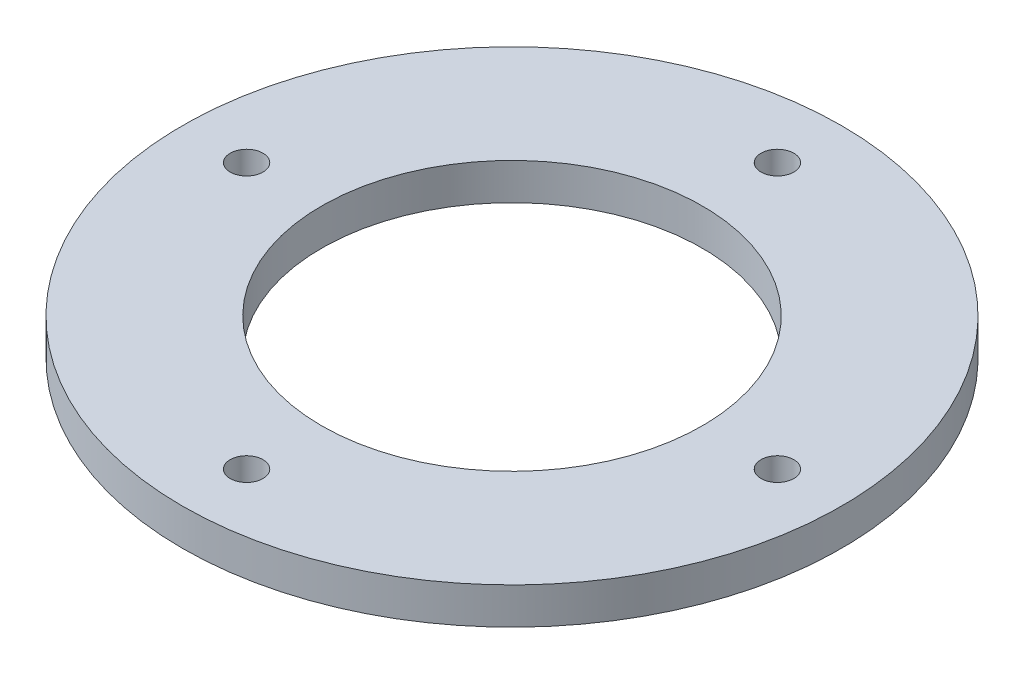
ISO-10303-21;
HEADER;
FILE_DESCRIPTION(('STEP AP214'),'2;1');
FILE_NAME('part.step','',(''),(''),'','','');
FILE_SCHEMA(('AUTOMOTIVE_DESIGN { 1 0 10303 214 1 1 1 1 }'));
ENDSEC;
DATA;
#1=APPLICATION_CONTEXT('core data for automotive mechanical design processes');
#2=APPLICATION_PROTOCOL_DEFINITION('international standard','automotive_design',2000,#1);
#3=PRODUCT_CONTEXT('',#1,'mechanical');
#4=PRODUCT('Part','Part','',(#3));
#5=PRODUCT_RELATED_PRODUCT_CATEGORY('part','',(#4));
#6=PRODUCT_DEFINITION_FORMATION('','',#4);
#7=PRODUCT_DEFINITION_CONTEXT('part definition',#1,'design');
#8=PRODUCT_DEFINITION('design','',#6,#7);
#9=PRODUCT_DEFINITION_SHAPE('','',#8);
#10=(LENGTH_UNIT() NAMED_UNIT(*) SI_UNIT(.MILLI.,.METRE.));
#11=(NAMED_UNIT(*) PLANE_ANGLE_UNIT() SI_UNIT($,.RADIAN.));
#12=(NAMED_UNIT(*) SI_UNIT($,.STERADIAN.) SOLID_ANGLE_UNIT());
#13=UNCERTAINTY_MEASURE_WITH_UNIT(LENGTH_MEASURE(1.E-05),#10,'distance_accuracy_value','');
#14=(GEOMETRIC_REPRESENTATION_CONTEXT(3) GLOBAL_UNCERTAINTY_ASSIGNED_CONTEXT((#13)) GLOBAL_UNIT_ASSIGNED_CONTEXT((#10,
#11,#12)) REPRESENTATION_CONTEXT('',''));
#15=CARTESIAN_POINT('',(0.,0.,0.));
#16=DIRECTION('',(0.,0.,1.));
#17=DIRECTION('',(1.,0.,0.));
#18=AXIS2_PLACEMENT_3D('',#15,#16,#17);
#19=CARTESIAN_POINT('',(0.,3.175,0.));
#20=DIRECTION('',(0.,1.,0.));
#21=DIRECTION('',(0.,0.,1.));
#22=AXIS2_PLACEMENT_3D('',#19,#20,#21);
#23=PLANE('',#22);
#24=CARTESIAN_POINT('',(-23.0124,3.175,0.));
#25=DIRECTION('',(0.,1.,0.));
#26=DIRECTION('',(0.,0.,1.));
#27=AXIS2_PLACEMENT_3D('',#24,#25,#26);
#28=CIRCLE('',#27,1.4224);
#29=CARTESIAN_POINT('',(-23.0124,3.175,1.4224));
#30=VERTEX_POINT('',#29);
#31=EDGE_CURVE('E61',#30,#30,#28,.T.);
#32=ORIENTED_EDGE('',*,*,#31,.F.);
#33=EDGE_LOOP('',(#32));
#34=FACE_BOUND('',#33,.T.);
#35=CARTESIAN_POINT('',(23.0124,3.175,0.));
#36=DIRECTION('',(0.,1.,0.));
#37=DIRECTION('',(0.,0.,1.));
#38=AXIS2_PLACEMENT_3D('',#35,#36,#37);
#39=CIRCLE('',#38,1.4224);
#40=CARTESIAN_POINT('',(23.0124,3.175,1.4224));
#41=VERTEX_POINT('',#40);
#42=EDGE_CURVE('E49',#41,#41,#39,.T.);
#43=ORIENTED_EDGE('',*,*,#42,.F.);
#44=EDGE_LOOP('',(#43));
#45=FACE_BOUND('',#44,.T.);
#46=CARTESIAN_POINT('',(0.,3.175,0.));
#47=DIRECTION('',(0.,1.,0.));
#48=DIRECTION('',(0.,0.,1.));
#49=AXIS2_PLACEMENT_3D('',#46,#47,#48);
#50=CIRCLE('',#49,28.575);
#51=CARTESIAN_POINT('',(0.,3.175,28.575));
#52=VERTEX_POINT('',#51);
#53=EDGE_CURVE('E10',#52,#52,#50,.T.);
#54=ORIENTED_EDGE('',*,*,#53,.T.);
#55=EDGE_LOOP('',(#54));
#56=FACE_BOUND('',#55,.T.);
#57=CARTESIAN_POINT('',(0.,3.175,0.));
#58=DIRECTION('',(0.,1.,0.));
#59=DIRECTION('',(0.,0.,1.));
#60=AXIS2_PLACEMENT_3D('',#57,#58,#59);
#61=CIRCLE('',#60,16.51);
#62=CARTESIAN_POINT('',(0.,3.175,16.51));
#63=VERTEX_POINT('',#62);
#64=EDGE_CURVE('E44',#63,#63,#61,.T.);
#65=ORIENTED_EDGE('',*,*,#64,.F.);
#66=EDGE_LOOP('',(#65));
#67=FACE_BOUND('',#66,.T.);
#68=CARTESIAN_POINT('',(0.,3.175,23.0124));
#69=DIRECTION('',(0.,1.,0.));
#70=DIRECTION('',(0.,0.,1.));
#71=AXIS2_PLACEMENT_3D('',#68,#69,#70);
#72=CIRCLE('',#71,1.4224);
#73=CARTESIAN_POINT('',(0.,3.175,24.4348));
#74=VERTEX_POINT('',#73);
#75=EDGE_CURVE('E55',#74,#74,#72,.T.);
#76=ORIENTED_EDGE('',*,*,#75,.F.);
#77=EDGE_LOOP('',(#76));
#78=FACE_BOUND('',#77,.T.);
#79=CARTESIAN_POINT('',(0.,3.175,-23.0124));
#80=DIRECTION('',(0.,1.,0.));
#81=DIRECTION('',(0.,0.,1.));
#82=AXIS2_PLACEMENT_3D('',#79,#80,#81);
#83=CIRCLE('',#82,1.4224);
#84=CARTESIAN_POINT('',(0.,3.175,-21.59));
#85=VERTEX_POINT('',#84);
#86=EDGE_CURVE('E67',#85,#85,#83,.T.);
#87=ORIENTED_EDGE('',*,*,#86,.F.);
#88=EDGE_LOOP('',(#87));
#89=FACE_BOUND('',#88,.T.);
#90=ADVANCED_FACE('F33',(#34,#45,#56,#67,#78,#89),#23,.T.);
#91=CARTESIAN_POINT('',(0.,0.,0.));
#92=DIRECTION('',(0.,1.,0.));
#93=DIRECTION('',(0.,0.,1.));
#94=AXIS2_PLACEMENT_3D('',#91,#92,#93);
#95=PLANE('',#94);
#96=CARTESIAN_POINT('',(-23.0124,0.,0.));
#97=DIRECTION('',(0.,1.,0.));
#98=DIRECTION('',(0.,0.,1.));
#99=AXIS2_PLACEMENT_3D('',#96,#97,#98);
#100=CIRCLE('',#99,1.4224);
#101=CARTESIAN_POINT('',(-23.0124,0.,1.4224));
#102=VERTEX_POINT('',#101);
#103=EDGE_CURVE('E64',#102,#102,#100,.T.);
#104=ORIENTED_EDGE('',*,*,#103,.T.);
#105=EDGE_LOOP('',(#104));
#106=FACE_BOUND('',#105,.T.);
#107=CARTESIAN_POINT('',(23.0124,0.,0.));
#108=DIRECTION('',(0.,1.,0.));
#109=DIRECTION('',(0.,0.,1.));
#110=AXIS2_PLACEMENT_3D('',#107,#108,#109);
#111=CIRCLE('',#110,1.4224);
#112=CARTESIAN_POINT('',(23.0124,0.,1.4224));
#113=VERTEX_POINT('',#112);
#114=EDGE_CURVE('E52',#113,#113,#111,.T.);
#115=ORIENTED_EDGE('',*,*,#114,.T.);
#116=EDGE_LOOP('',(#115));
#117=FACE_BOUND('',#116,.T.);
#118=CARTESIAN_POINT('',(0.,0.,0.));
#119=DIRECTION('',(0.,1.,0.));
#120=DIRECTION('',(0.,0.,1.));
#121=AXIS2_PLACEMENT_3D('',#118,#119,#120);
#122=CIRCLE('',#121,28.575);
#123=CARTESIAN_POINT('',(0.,0.,28.575));
#124=VERTEX_POINT('',#123);
#125=EDGE_CURVE('E37',#124,#124,#122,.T.);
#126=ORIENTED_EDGE('',*,*,#125,.F.);
#127=EDGE_LOOP('',(#126));
#128=FACE_BOUND('',#127,.T.);
#129=CARTESIAN_POINT('',(0.,0.,0.));
#130=DIRECTION('',(0.,1.,0.));
#131=DIRECTION('',(0.,0.,1.));
#132=AXIS2_PLACEMENT_3D('',#129,#130,#131);
#133=CIRCLE('',#132,16.51);
#134=CARTESIAN_POINT('',(0.,0.,16.51));
#135=VERTEX_POINT('',#134);
#136=EDGE_CURVE('E46',#135,#135,#133,.T.);
#137=ORIENTED_EDGE('',*,*,#136,.T.);
#138=EDGE_LOOP('',(#137));
#139=FACE_BOUND('',#138,.T.);
#140=CARTESIAN_POINT('',(0.,0.,23.0124));
#141=DIRECTION('',(0.,1.,0.));
#142=DIRECTION('',(0.,0.,1.));
#143=AXIS2_PLACEMENT_3D('',#140,#141,#142);
#144=CIRCLE('',#143,1.4224);
#145=CARTESIAN_POINT('',(0.,0.,24.4348));
#146=VERTEX_POINT('',#145);
#147=EDGE_CURVE('E58',#146,#146,#144,.T.);
#148=ORIENTED_EDGE('',*,*,#147,.T.);
#149=EDGE_LOOP('',(#148));
#150=FACE_BOUND('',#149,.T.);
#151=CARTESIAN_POINT('',(0.,0.,-23.0124));
#152=DIRECTION('',(0.,1.,0.));
#153=DIRECTION('',(0.,0.,1.));
#154=AXIS2_PLACEMENT_3D('',#151,#152,#153);
#155=CIRCLE('',#154,1.4224);
#156=CARTESIAN_POINT('',(0.,0.,-21.59));
#157=VERTEX_POINT('',#156);
#158=EDGE_CURVE('E70',#157,#157,#155,.T.);
#159=ORIENTED_EDGE('',*,*,#158,.T.);
#160=EDGE_LOOP('',(#159));
#161=FACE_BOUND('',#160,.T.);
#162=ADVANCED_FACE('F80',(#106,#117,#128,#139,#150,#161),#95,.F.);
#163=CARTESIAN_POINT('',(0.,3.175,0.));
#164=DIRECTION('',(0.,-1.,0.));
#165=DIRECTION('',(0.,0.,-1.));
#166=AXIS2_PLACEMENT_3D('',#163,#164,#165);
#167=CYLINDRICAL_SURFACE('',#166,28.575);
#168=ORIENTED_EDGE('',*,*,#53,.F.);
#169=EDGE_LOOP('',(#168));
#170=FACE_BOUND('',#169,.T.);
#171=ORIENTED_EDGE('',*,*,#125,.T.);
#172=EDGE_LOOP('',(#171));
#173=FACE_BOUND('',#172,.T.);
#174=ADVANCED_FACE('F35',(#170,#173),#167,.T.);
#175=CARTESIAN_POINT('',(0.,3.175,0.));
#176=DIRECTION('',(0.,-1.,0.));
#177=DIRECTION('',(0.,0.,-1.));
#178=AXIS2_PLACEMENT_3D('',#175,#176,#177);
#179=CYLINDRICAL_SURFACE('',#178,16.51);
#180=ORIENTED_EDGE('',*,*,#64,.T.);
#181=EDGE_LOOP('',(#180));
#182=FACE_BOUND('',#181,.T.);
#183=ORIENTED_EDGE('',*,*,#136,.F.);
#184=EDGE_LOOP('',(#183));
#185=FACE_BOUND('',#184,.T.);
#186=ADVANCED_FACE('F90',(#182,#185),#179,.F.);
#187=CARTESIAN_POINT('',(23.0124,3.175,0.));
#188=DIRECTION('',(0.,-1.,0.));
#189=DIRECTION('',(0.,0.,-1.));
#190=AXIS2_PLACEMENT_3D('',#187,#188,#189);
#191=CYLINDRICAL_SURFACE('',#190,1.4224);
#192=ORIENTED_EDGE('',*,*,#42,.T.);
#193=EDGE_LOOP('',(#192));
#194=FACE_BOUND('',#193,.T.);
#195=ORIENTED_EDGE('',*,*,#114,.F.);
#196=EDGE_LOOP('',(#195));
#197=FACE_BOUND('',#196,.T.);
#198=ADVANCED_FACE('F93',(#194,#197),#191,.F.);
#199=CARTESIAN_POINT('',(0.,3.175,23.0124));
#200=DIRECTION('',(0.,-1.,0.));
#201=DIRECTION('',(0.,0.,-1.));
#202=AXIS2_PLACEMENT_3D('',#199,#200,#201);
#203=CYLINDRICAL_SURFACE('',#202,1.4224);
#204=ORIENTED_EDGE('',*,*,#75,.T.);
#205=EDGE_LOOP('',(#204));
#206=FACE_BOUND('',#205,.T.);
#207=ORIENTED_EDGE('',*,*,#147,.F.);
#208=EDGE_LOOP('',(#207));
#209=FACE_BOUND('',#208,.T.);
#210=ADVANCED_FACE('F97',(#206,#209),#203,.F.);
#211=CARTESIAN_POINT('',(-23.0124,3.175,0.));
#212=DIRECTION('',(0.,-1.,0.));
#213=DIRECTION('',(0.,0.,-1.));
#214=AXIS2_PLACEMENT_3D('',#211,#212,#213);
#215=CYLINDRICAL_SURFACE('',#214,1.4224);
#216=ORIENTED_EDGE('',*,*,#31,.T.);
#217=EDGE_LOOP('',(#216));
#218=FACE_BOUND('',#217,.T.);
#219=ORIENTED_EDGE('',*,*,#103,.F.);
#220=EDGE_LOOP('',(#219));
#221=FACE_BOUND('',#220,.T.);
#222=ADVANCED_FACE('F101',(#218,#221),#215,.F.);
#223=CARTESIAN_POINT('',(0.,3.175,-23.0124));
#224=DIRECTION('',(0.,-1.,0.));
#225=DIRECTION('',(0.,0.,-1.));
#226=AXIS2_PLACEMENT_3D('',#223,#224,#225);
#227=CYLINDRICAL_SURFACE('',#226,1.4224);
#228=ORIENTED_EDGE('',*,*,#86,.T.);
#229=EDGE_LOOP('',(#228));
#230=FACE_BOUND('',#229,.T.);
#231=ORIENTED_EDGE('',*,*,#158,.F.);
#232=EDGE_LOOP('',(#231));
#233=FACE_BOUND('',#232,.T.);
#234=ADVANCED_FACE('F76',(#230,#233),#227,.F.);
#235=CLOSED_SHELL('',(#90,#162,#174,#186,#198,#210,#222,#234));
#236=MANIFOLD_SOLID_BREP('B2',#235);
#237=ADVANCED_BREP_SHAPE_REPRESENTATION('',(#18,#236),#14);
#238=SHAPE_DEFINITION_REPRESENTATION(#9,#237);
ENDSEC;
END-ISO-10303-21;
